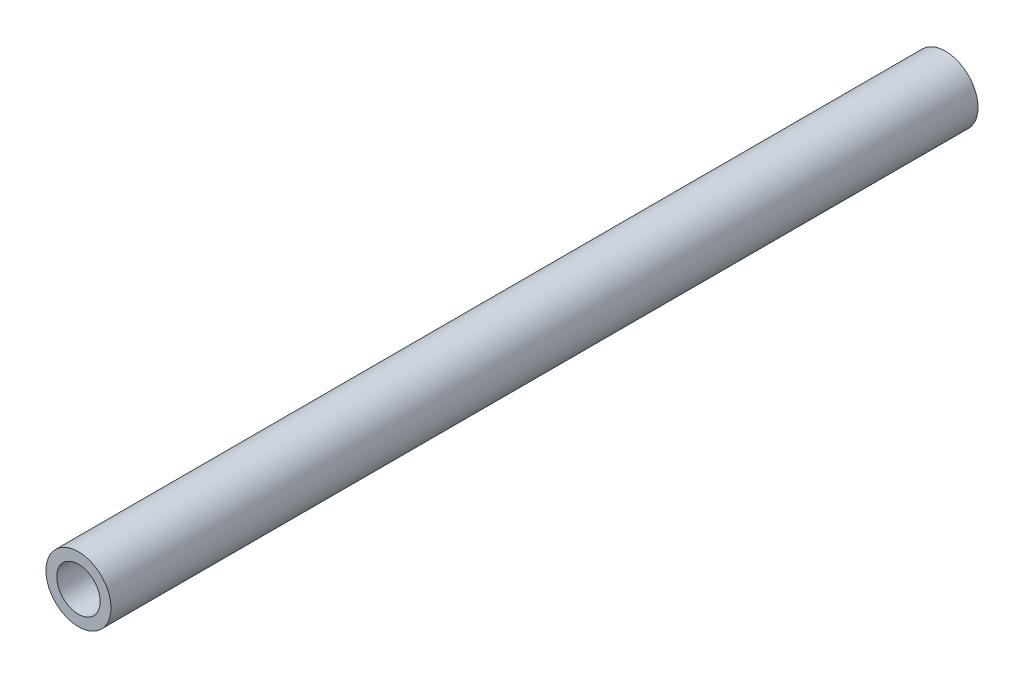
ISO-10303-21;
HEADER;
FILE_DESCRIPTION(('STEP AP214'),'2;1');
FILE_NAME('part.step','',(''),(''),'','','');
FILE_SCHEMA(('AUTOMOTIVE_DESIGN { 1 0 10303 214 1 1 1 1 }'));
ENDSEC;
DATA;
#1=APPLICATION_CONTEXT('core data for automotive mechanical design processes');
#2=APPLICATION_PROTOCOL_DEFINITION('international standard','automotive_design',2000,#1);
#3=PRODUCT_CONTEXT('',#1,'mechanical');
#4=PRODUCT('Part','Part','',(#3));
#5=PRODUCT_RELATED_PRODUCT_CATEGORY('part','',(#4));
#6=PRODUCT_DEFINITION_FORMATION('','',#4);
#7=PRODUCT_DEFINITION_CONTEXT('part definition',#1,'design');
#8=PRODUCT_DEFINITION('design','',#6,#7);
#9=PRODUCT_DEFINITION_SHAPE('','',#8);
#10=(LENGTH_UNIT() NAMED_UNIT(*) SI_UNIT(.MILLI.,.METRE.));
#11=(NAMED_UNIT(*) PLANE_ANGLE_UNIT() SI_UNIT($,.RADIAN.));
#12=(NAMED_UNIT(*) SI_UNIT($,.STERADIAN.) SOLID_ANGLE_UNIT());
#13=UNCERTAINTY_MEASURE_WITH_UNIT(LENGTH_MEASURE(1.E-05),#10,'distance_accuracy_value','');
#14=(GEOMETRIC_REPRESENTATION_CONTEXT(3) GLOBAL_UNCERTAINTY_ASSIGNED_CONTEXT((#13)) GLOBAL_UNIT_ASSIGNED_CONTEXT((#10,
#11,#12)) REPRESENTATION_CONTEXT('',''));
#15=CARTESIAN_POINT('',(0.,0.,0.));
#16=DIRECTION('',(0.,0.,1.));
#17=DIRECTION('',(1.,0.,0.));
#18=AXIS2_PLACEMENT_3D('',#15,#16,#17);
#19=CARTESIAN_POINT('',(0.,0.,203.2));
#20=DIRECTION('',(0.,0.,1.));
#21=DIRECTION('',(1.,0.,0.));
#22=AXIS2_PLACEMENT_3D('',#19,#20,#21);
#23=PLANE('',#22);
#24=CARTESIAN_POINT('',(0.,0.,203.2));
#25=DIRECTION('',(0.,0.,1.));
#26=DIRECTION('',(1.,0.,0.));
#27=AXIS2_PLACEMENT_3D('',#24,#25,#26);
#28=CIRCLE('',#27,7.62);
#29=CARTESIAN_POINT('',(7.62,0.,203.2));
#30=VERTEX_POINT('',#29);
#31=EDGE_CURVE('E10',#30,#30,#28,.T.);
#32=ORIENTED_EDGE('',*,*,#31,.T.);
#33=EDGE_LOOP('',(#32));
#34=FACE_BOUND('',#33,.T.);
#35=CARTESIAN_POINT('',(0.,0.,203.2));
#36=DIRECTION('',(0.,0.,1.));
#37=DIRECTION('',(1.,0.,0.));
#38=AXIS2_PLACEMENT_3D('',#35,#36,#37);
#39=CIRCLE('',#38,5.08);
#40=CARTESIAN_POINT('',(5.08,0.,203.2));
#41=VERTEX_POINT('',#40);
#42=EDGE_CURVE('E41',#41,#41,#39,.T.);
#43=ORIENTED_EDGE('',*,*,#42,.F.);
#44=EDGE_LOOP('',(#43));
#45=FACE_BOUND('',#44,.T.);
#46=ADVANCED_FACE('F30',(#34,#45),#23,.T.);
#47=CARTESIAN_POINT('',(0.,0.,0.));
#48=DIRECTION('',(0.,0.,1.));
#49=DIRECTION('',(1.,0.,0.));
#50=AXIS2_PLACEMENT_3D('',#47,#48,#49);
#51=PLANE('',#50);
#52=CARTESIAN_POINT('',(0.,0.,0.));
#53=DIRECTION('',(0.,0.,1.));
#54=DIRECTION('',(1.,0.,0.));
#55=AXIS2_PLACEMENT_3D('',#52,#53,#54);
#56=CIRCLE('',#55,7.62);
#57=CARTESIAN_POINT('',(7.62,0.,0.));
#58=VERTEX_POINT('',#57);
#59=EDGE_CURVE('E34',#58,#58,#56,.T.);
#60=ORIENTED_EDGE('',*,*,#59,.F.);
#61=EDGE_LOOP('',(#60));
#62=FACE_BOUND('',#61,.T.);
#63=CARTESIAN_POINT('',(0.,0.,0.));
#64=DIRECTION('',(0.,0.,1.));
#65=DIRECTION('',(1.,0.,0.));
#66=AXIS2_PLACEMENT_3D('',#63,#64,#65);
#67=CIRCLE('',#66,5.08);
#68=CARTESIAN_POINT('',(5.08,0.,0.));
#69=VERTEX_POINT('',#68);
#70=EDGE_CURVE('E43',#69,#69,#67,.T.);
#71=ORIENTED_EDGE('',*,*,#70,.T.);
#72=EDGE_LOOP('',(#71));
#73=FACE_BOUND('',#72,.T.);
#74=ADVANCED_FACE('F53',(#62,#73),#51,.F.);
#75=CARTESIAN_POINT('',(0.,0.,203.2));
#76=DIRECTION('',(0.,0.,-1.));
#77=DIRECTION('',(-1.,0.,0.));
#78=AXIS2_PLACEMENT_3D('',#75,#76,#77);
#79=CYLINDRICAL_SURFACE('',#78,7.62);
#80=ORIENTED_EDGE('',*,*,#31,.F.);
#81=EDGE_LOOP('',(#80));
#82=FACE_BOUND('',#81,.T.);
#83=ORIENTED_EDGE('',*,*,#59,.T.);
#84=EDGE_LOOP('',(#83));
#85=FACE_BOUND('',#84,.T.);
#86=ADVANCED_FACE('F32',(#82,#85),#79,.T.);
#87=CARTESIAN_POINT('',(0.,0.,203.2));
#88=DIRECTION('',(0.,0.,-1.));
#89=DIRECTION('',(-1.,0.,0.));
#90=AXIS2_PLACEMENT_3D('',#87,#88,#89);
#91=CYLINDRICAL_SURFACE('',#90,5.08);
#92=ORIENTED_EDGE('',*,*,#42,.T.);
#93=EDGE_LOOP('',(#92));
#94=FACE_BOUND('',#93,.T.);
#95=ORIENTED_EDGE('',*,*,#70,.F.);
#96=EDGE_LOOP('',(#95));
#97=FACE_BOUND('',#96,.T.);
#98=ADVANCED_FACE('F49',(#94,#97),#91,.F.);
#99=CLOSED_SHELL('',(#46,#74,#86,#98));
#100=MANIFOLD_SOLID_BREP('B2',#99);
#101=ADVANCED_BREP_SHAPE_REPRESENTATION('',(#18,#100),#14);
#102=SHAPE_DEFINITION_REPRESENTATION(#9,#101);
ENDSEC;
END-ISO-10303-21;
